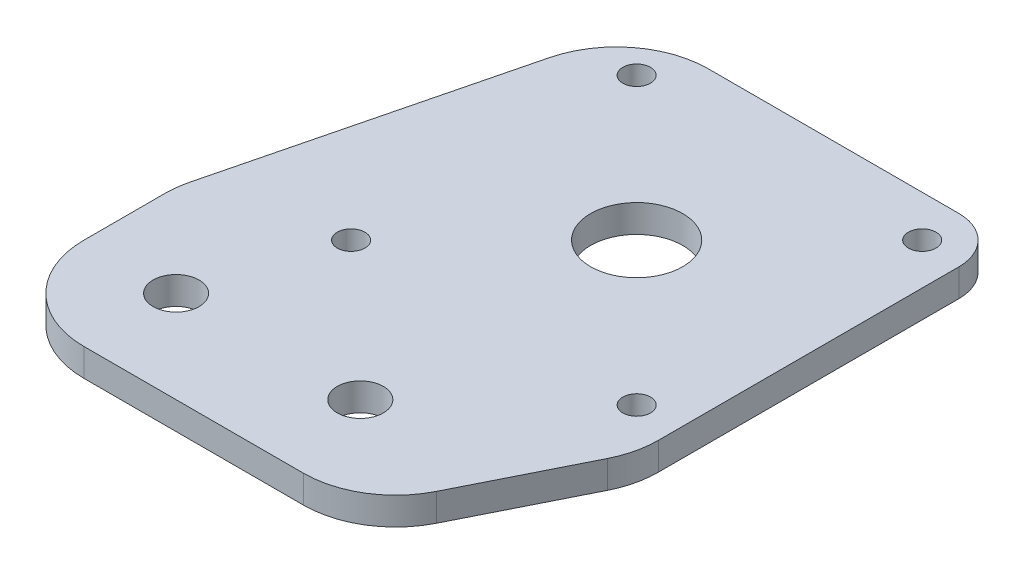
ISO-10303-21;
HEADER;
FILE_DESCRIPTION(('STEP AP214'),'2;1');
FILE_NAME('part.step','',(''),(''),'','','');
FILE_SCHEMA(('AUTOMOTIVE_DESIGN { 1 0 10303 214 1 1 1 1 }'));
ENDSEC;
DATA;
#1=APPLICATION_CONTEXT('core data for automotive mechanical design processes');
#2=APPLICATION_PROTOCOL_DEFINITION('international standard','automotive_design',2000,#1);
#3=PRODUCT_CONTEXT('',#1,'mechanical');
#4=PRODUCT('Part','Part','',(#3));
#5=PRODUCT_RELATED_PRODUCT_CATEGORY('part','',(#4));
#6=PRODUCT_DEFINITION_FORMATION('','',#4);
#7=PRODUCT_DEFINITION_CONTEXT('part definition',#1,'design');
#8=PRODUCT_DEFINITION('design','',#6,#7);
#9=PRODUCT_DEFINITION_SHAPE('','',#8);
#10=(LENGTH_UNIT() NAMED_UNIT(*) SI_UNIT(.MILLI.,.METRE.));
#11=(NAMED_UNIT(*) PLANE_ANGLE_UNIT() SI_UNIT($,.RADIAN.));
#12=(NAMED_UNIT(*) SI_UNIT($,.STERADIAN.) SOLID_ANGLE_UNIT());
#13=UNCERTAINTY_MEASURE_WITH_UNIT(LENGTH_MEASURE(1.E-05),#10,'distance_accuracy_value','');
#14=(GEOMETRIC_REPRESENTATION_CONTEXT(3) GLOBAL_UNCERTAINTY_ASSIGNED_CONTEXT((#13)) GLOBAL_UNIT_ASSIGNED_CONTEXT((#10,
#11,#12)) REPRESENTATION_CONTEXT('',''));
#15=CARTESIAN_POINT('',(0.,0.,0.));
#16=DIRECTION('',(0.,0.,1.));
#17=DIRECTION('',(1.,0.,0.));
#18=AXIS2_PLACEMENT_3D('',#15,#16,#17);
#19=CARTESIAN_POINT('',(0.,3.,0.));
#20=DIRECTION('',(0.,-1.,0.));
#21=DIRECTION('',(0.,0.,-1.));
#22=AXIS2_PLACEMENT_3D('',#19,#20,#21);
#23=PLANE('',#22);
#24=CARTESIAN_POINT('',(0.,3.,30.));
#25=DIRECTION('',(0.,1.,0.));
#26=DIRECTION('',(0.,0.,1.));
#27=AXIS2_PLACEMENT_3D('',#24,#25,#26);
#28=CIRCLE('',#27,2.5);
#29=CARTESIAN_POINT('',(0.,3.,32.5));
#30=VERTEX_POINT('',#29);
#31=EDGE_CURVE('E273',#30,#30,#28,.T.);
#32=ORIENTED_EDGE('',*,*,#31,.F.);
#33=EDGE_LOOP('',(#32));
#34=FACE_BOUND('',#33,.T.);
#35=CARTESIAN_POINT('',(-20.,3.,30.));
#36=DIRECTION('',(0.,1.,0.));
#37=DIRECTION('',(0.,0.,1.));
#38=AXIS2_PLACEMENT_3D('',#35,#36,#37);
#39=CIRCLE('',#38,2.5);
#40=CARTESIAN_POINT('',(-20.,3.,32.5));
#41=VERTEX_POINT('',#40);
#42=EDGE_CURVE('E267',#41,#41,#39,.T.);
#43=ORIENTED_EDGE('',*,*,#42,.F.);
#44=EDGE_LOOP('',(#43));
#45=FACE_BOUND('',#44,.T.);
#46=CARTESIAN_POINT('',(15.5,3.,-15.5));
#47=DIRECTION('',(0.,1.,0.));
#48=DIRECTION('',(0.,0.,1.));
#49=AXIS2_PLACEMENT_3D('',#46,#47,#48);
#50=CIRCLE('',#49,1.5);
#51=CARTESIAN_POINT('',(15.5,3.,-14.));
#52=VERTEX_POINT('',#51);
#53=EDGE_CURVE('E258',#52,#52,#50,.T.);
#54=ORIENTED_EDGE('',*,*,#53,.F.);
#55=EDGE_LOOP('',(#54));
#56=FACE_BOUND('',#55,.T.);
#57=CARTESIAN_POINT('',(-15.5,3.,-15.5));
#58=DIRECTION('',(0.,1.,0.));
#59=DIRECTION('',(0.,0.,1.));
#60=AXIS2_PLACEMENT_3D('',#57,#58,#59);
#61=CIRCLE('',#60,1.5);
#62=CARTESIAN_POINT('',(-15.5,3.,-14.));
#63=VERTEX_POINT('',#62);
#64=EDGE_CURVE('E255',#63,#63,#61,.T.);
#65=ORIENTED_EDGE('',*,*,#64,.F.);
#66=EDGE_LOOP('',(#65));
#67=FACE_BOUND('',#66,.T.);
#68=DIRECTION('',(0.,0.,-1.));
#69=VECTOR('',#68,1.);
#70=CARTESIAN_POINT('',(20.,3.,-20.));
#71=LINE('',#70,#69);
#72=CARTESIAN_POINT('',(20.,3.,17.6393202250021));
#73=VERTEX_POINT('',#72);
#74=CARTESIAN_POINT('',(20.,3.,-15.));
#75=VERTEX_POINT('',#74);
#76=EDGE_CURVE('E244',#73,#75,#71,.T.);
#77=ORIENTED_EDGE('',*,*,#76,.T.);
#78=CARTESIAN_POINT('',(15.,3.,-15.));
#79=DIRECTION('',(0.,-1.,0.));
#80=DIRECTION('',(0.,0.,-1.));
#81=AXIS2_PLACEMENT_3D('',#78,#79,#80);
#82=CIRCLE('',#81,5.);
#83=CARTESIAN_POINT('',(15.,3.,-20.));
#84=VERTEX_POINT('',#83);
#85=EDGE_CURVE('E11',#75,#84,#82,.F.);
#86=ORIENTED_EDGE('',*,*,#85,.T.);
#87=DIRECTION('',(-1.,0.,0.));
#88=VECTOR('',#87,1.);
#89=CARTESIAN_POINT('',(-20.,3.,-20.));
#90=LINE('',#89,#88);
#91=CARTESIAN_POINT('',(-12.1922359359558,3.,-20.));
#92=VERTEX_POINT('',#91);
#93=EDGE_CURVE('E225',#84,#92,#90,.T.);
#94=ORIENTED_EDGE('',*,*,#93,.T.);
#95=CARTESIAN_POINT('',(-12.1922359359559,3.,-10.));
#96=DIRECTION('',(0.,-1.,0.));
#97=DIRECTION('',(0.,0.,-1.));
#98=AXIS2_PLACEMENT_3D('',#95,#96,#97);
#99=CIRCLE('',#98,10.);
#100=CARTESIAN_POINT('',(-21.8936609374092,3.,-12.4253562503633));
#101=VERTEX_POINT('',#100);
#102=EDGE_CURVE('E194',#92,#101,#99,.F.);
#103=ORIENTED_EDGE('',*,*,#102,.T.);
#104=DIRECTION('',(-0.242535625036333,0.,0.970142500145332));
#105=VECTOR('',#104,1.);
#106=CARTESIAN_POINT('',(-20.,3.,-20.));
#107=LINE('',#106,#105);
#108=CARTESIAN_POINT('',(-29.7014250014533,3.,18.8057000058133));
#109=VERTEX_POINT('',#108);
#110=EDGE_CURVE('E238',#101,#109,#107,.T.);
#111=ORIENTED_EDGE('',*,*,#110,.T.);
#112=CARTESIAN_POINT('',(-20.,3.,21.2310562561766));
#113=DIRECTION('',(0.,-1.,0.));
#114=DIRECTION('',(0.,0.,-1.));
#115=AXIS2_PLACEMENT_3D('',#112,#113,#114);
#116=CIRCLE('',#115,10.);
#117=CARTESIAN_POINT('',(-30.,3.,21.2310562561766));
#118=VERTEX_POINT('',#117);
#119=EDGE_CURVE('E192',#109,#118,#116,.F.);
#120=ORIENTED_EDGE('',*,*,#119,.T.);
#121=DIRECTION('',(0.,0.,1.));
#122=VECTOR('',#121,1.);
#123=CARTESIAN_POINT('',(-30.,3.,20.));
#124=LINE('',#123,#122);
#125=CARTESIAN_POINT('',(-30.,3.,30.));
#126=VERTEX_POINT('',#125);
#127=EDGE_CURVE('E158',#118,#126,#124,.T.);
#128=ORIENTED_EDGE('',*,*,#127,.T.);
#129=CARTESIAN_POINT('',(-20.,3.,30.));
#130=DIRECTION('',(0.,-1.,0.));
#131=DIRECTION('',(0.,0.,-1.));
#132=AXIS2_PLACEMENT_3D('',#129,#130,#131);
#133=CIRCLE('',#132,10.);
#134=CARTESIAN_POINT('',(-20.,3.,40.));
#135=VERTEX_POINT('',#134);
#136=EDGE_CURVE('E200',#126,#135,#133,.F.);
#137=ORIENTED_EDGE('',*,*,#136,.T.);
#138=DIRECTION('',(1.,0.,0.));
#139=VECTOR('',#138,1.);
#140=CARTESIAN_POINT('',(-30.,3.,40.));
#141=LINE('',#140,#139);
#142=CARTESIAN_POINT('',(3.81966011250106,3.,40.));
#143=VERTEX_POINT('',#142);
#144=EDGE_CURVE('E141',#135,#143,#141,.T.);
#145=ORIENTED_EDGE('',*,*,#144,.T.);
#146=CARTESIAN_POINT('',(3.81966011250106,3.,30.));
#147=DIRECTION('',(0.,-1.,0.));
#148=DIRECTION('',(0.,0.,-1.));
#149=AXIS2_PLACEMENT_3D('',#146,#147,#148);
#150=CIRCLE('',#149,10.);
#151=CARTESIAN_POINT('',(12.7639320225002,3.,34.4721359549996));
#152=VERTEX_POINT('',#151);
#153=EDGE_CURVE('E198',#143,#152,#150,.F.);
#154=ORIENTED_EDGE('',*,*,#153,.T.);
#155=DIRECTION('',(0.447213595499958,0.,-0.894427190999916));
#156=VECTOR('',#155,1.);
#157=CARTESIAN_POINT('',(20.,3.,20.));
#158=LINE('',#157,#156);
#159=CARTESIAN_POINT('',(18.9442719099992,3.,22.1114561800017));
#160=VERTEX_POINT('',#159);
#161=EDGE_CURVE('E248',#152,#160,#158,.T.);
#162=ORIENTED_EDGE('',*,*,#161,.T.);
#163=CARTESIAN_POINT('',(10.,3.,17.6393202250021));
#164=DIRECTION('',(0.,-1.,0.));
#165=DIRECTION('',(0.,0.,-1.));
#166=AXIS2_PLACEMENT_3D('',#163,#164,#165);
#167=CIRCLE('',#166,10.);
#168=EDGE_CURVE('E196',#160,#73,#167,.F.);
#169=ORIENTED_EDGE('',*,*,#168,.T.);
#170=EDGE_LOOP('',(#77,#86,#94,#103,#111,#120,#128,#137,#145,#154,#162,#169));
#171=FACE_BOUND('',#170,.T.);
#172=CARTESIAN_POINT('',(0.,3.,0.));
#173=DIRECTION('',(0.,1.,0.));
#174=DIRECTION('',(0.,0.,1.));
#175=AXIS2_PLACEMENT_3D('',#172,#173,#174);
#176=CIRCLE('',#175,5.);
#177=CARTESIAN_POINT('',(0.,3.,5.));
#178=VERTEX_POINT('',#177);
#179=EDGE_CURVE('E149',#178,#178,#176,.T.);
#180=ORIENTED_EDGE('',*,*,#179,.F.);
#181=EDGE_LOOP('',(#180));
#182=FACE_BOUND('',#181,.T.);
#183=CARTESIAN_POINT('',(-15.5,3.,15.5));
#184=DIRECTION('',(0.,1.,0.));
#185=DIRECTION('',(0.,0.,1.));
#186=AXIS2_PLACEMENT_3D('',#183,#184,#185);
#187=CIRCLE('',#186,1.5);
#188=CARTESIAN_POINT('',(-15.5,3.,17.));
#189=VERTEX_POINT('',#188);
#190=EDGE_CURVE('E172',#189,#189,#187,.T.);
#191=ORIENTED_EDGE('',*,*,#190,.F.);
#192=EDGE_LOOP('',(#191));
#193=FACE_BOUND('',#192,.T.);
#194=CARTESIAN_POINT('',(15.5,3.,15.5));
#195=DIRECTION('',(0.,1.,0.));
#196=DIRECTION('',(0.,0.,1.));
#197=AXIS2_PLACEMENT_3D('',#194,#195,#196);
#198=CIRCLE('',#197,1.5);
#199=CARTESIAN_POINT('',(15.5,3.,17.));
#200=VERTEX_POINT('',#199);
#201=EDGE_CURVE('E178',#200,#200,#198,.T.);
#202=ORIENTED_EDGE('',*,*,#201,.F.);
#203=EDGE_LOOP('',(#202));
#204=FACE_BOUND('',#203,.T.);
#205=ADVANCED_FACE('F33',(#34,#45,#56,#67,#171,#182,#193,#204),#23,.F.);
#206=CARTESIAN_POINT('',(0.,0.,0.));
#207=DIRECTION('',(0.,-1.,0.));
#208=DIRECTION('',(0.,0.,-1.));
#209=AXIS2_PLACEMENT_3D('',#206,#207,#208);
#210=PLANE('',#209);
#211=CARTESIAN_POINT('',(0.,0.,30.));
#212=DIRECTION('',(0.,1.,0.));
#213=DIRECTION('',(0.,0.,1.));
#214=AXIS2_PLACEMENT_3D('',#211,#212,#213);
#215=CIRCLE('',#214,2.5);
#216=CARTESIAN_POINT('',(0.,0.,32.5));
#217=VERTEX_POINT('',#216);
#218=EDGE_CURVE('E270',#217,#217,#215,.T.);
#219=ORIENTED_EDGE('',*,*,#218,.T.);
#220=EDGE_LOOP('',(#219));
#221=FACE_BOUND('',#220,.T.);
#222=CARTESIAN_POINT('',(-20.,0.,30.));
#223=DIRECTION('',(0.,1.,0.));
#224=DIRECTION('',(0.,0.,1.));
#225=AXIS2_PLACEMENT_3D('',#222,#223,#224);
#226=CIRCLE('',#225,2.5);
#227=CARTESIAN_POINT('',(-20.,0.,32.5));
#228=VERTEX_POINT('',#227);
#229=EDGE_CURVE('E266',#228,#228,#226,.T.);
#230=ORIENTED_EDGE('',*,*,#229,.T.);
#231=EDGE_LOOP('',(#230));
#232=FACE_BOUND('',#231,.T.);
#233=CARTESIAN_POINT('',(15.5,0.,-15.5));
#234=DIRECTION('',(0.,1.,0.));
#235=DIRECTION('',(0.,0.,1.));
#236=AXIS2_PLACEMENT_3D('',#233,#234,#235);
#237=CIRCLE('',#236,1.5);
#238=CARTESIAN_POINT('',(15.5,0.,-14.));
#239=VERTEX_POINT('',#238);
#240=EDGE_CURVE('E263',#239,#239,#237,.T.);
#241=ORIENTED_EDGE('',*,*,#240,.T.);
#242=EDGE_LOOP('',(#241));
#243=FACE_BOUND('',#242,.T.);
#244=CARTESIAN_POINT('',(-15.5,0.,-15.5));
#245=DIRECTION('',(0.,1.,0.));
#246=DIRECTION('',(0.,0.,1.));
#247=AXIS2_PLACEMENT_3D('',#244,#245,#246);
#248=CIRCLE('',#247,1.5);
#249=CARTESIAN_POINT('',(-15.5,0.,-14.));
#250=VERTEX_POINT('',#249);
#251=EDGE_CURVE('E253',#250,#250,#248,.T.);
#252=ORIENTED_EDGE('',*,*,#251,.T.);
#253=EDGE_LOOP('',(#252));
#254=FACE_BOUND('',#253,.T.);
#255=DIRECTION('',(-1.,0.,0.));
#256=VECTOR('',#255,1.);
#257=CARTESIAN_POINT('',(-20.,0.,-20.));
#258=LINE('',#257,#256);
#259=CARTESIAN_POINT('',(15.,0.,-20.));
#260=VERTEX_POINT('',#259);
#261=CARTESIAN_POINT('',(-12.1922359359558,0.,-20.));
#262=VERTEX_POINT('',#261);
#263=EDGE_CURVE('E162',#260,#262,#258,.T.);
#264=ORIENTED_EDGE('',*,*,#263,.F.);
#265=CARTESIAN_POINT('',(15.,0.,-15.));
#266=DIRECTION('',(0.,-1.,0.));
#267=DIRECTION('',(0.,0.,-1.));
#268=AXIS2_PLACEMENT_3D('',#265,#266,#267);
#269=CIRCLE('',#268,5.);
#270=CARTESIAN_POINT('',(20.,0.,-15.));
#271=VERTEX_POINT('',#270);
#272=EDGE_CURVE('E55',#260,#271,#269,.T.);
#273=ORIENTED_EDGE('',*,*,#272,.T.);
#274=DIRECTION('',(0.,0.,-1.));
#275=VECTOR('',#274,1.);
#276=CARTESIAN_POINT('',(20.,0.,-20.));
#277=LINE('',#276,#275);
#278=CARTESIAN_POINT('',(20.,0.,17.6393202250021));
#279=VERTEX_POINT('',#278);
#280=EDGE_CURVE('E152',#279,#271,#277,.T.);
#281=ORIENTED_EDGE('',*,*,#280,.F.);
#282=CARTESIAN_POINT('',(10.,0.,17.6393202250021));
#283=DIRECTION('',(0.,-1.,0.));
#284=DIRECTION('',(0.,0.,-1.));
#285=AXIS2_PLACEMENT_3D('',#282,#283,#284);
#286=CIRCLE('',#285,10.);
#287=CARTESIAN_POINT('',(18.9442719099992,0.,22.1114561800017));
#288=VERTEX_POINT('',#287);
#289=EDGE_CURVE('E186',#279,#288,#286,.T.);
#290=ORIENTED_EDGE('',*,*,#289,.T.);
#291=DIRECTION('',(0.447213595499958,0.,-0.894427190999916));
#292=VECTOR('',#291,1.);
#293=CARTESIAN_POINT('',(20.,0.,20.));
#294=LINE('',#293,#292);
#295=CARTESIAN_POINT('',(12.7639320225002,0.,34.4721359549996));
#296=VERTEX_POINT('',#295);
#297=EDGE_CURVE('E148',#296,#288,#294,.T.);
#298=ORIENTED_EDGE('',*,*,#297,.F.);
#299=CARTESIAN_POINT('',(3.81966011250106,0.,30.));
#300=DIRECTION('',(0.,-1.,0.));
#301=DIRECTION('',(0.,0.,-1.));
#302=AXIS2_PLACEMENT_3D('',#299,#300,#301);
#303=CIRCLE('',#302,10.);
#304=CARTESIAN_POINT('',(3.81966011250106,0.,40.));
#305=VERTEX_POINT('',#304);
#306=EDGE_CURVE('E132',#296,#305,#303,.T.);
#307=ORIENTED_EDGE('',*,*,#306,.T.);
#308=DIRECTION('',(1.,0.,0.));
#309=VECTOR('',#308,1.);
#310=CARTESIAN_POINT('',(-30.,0.,40.));
#311=LINE('',#310,#309);
#312=CARTESIAN_POINT('',(-20.,0.,40.));
#313=VERTEX_POINT('',#312);
#314=EDGE_CURVE('E138',#313,#305,#311,.T.);
#315=ORIENTED_EDGE('',*,*,#314,.F.);
#316=CARTESIAN_POINT('',(-20.,0.,30.));
#317=DIRECTION('',(0.,-1.,0.));
#318=DIRECTION('',(0.,0.,-1.));
#319=AXIS2_PLACEMENT_3D('',#316,#317,#318);
#320=CIRCLE('',#319,10.);
#321=CARTESIAN_POINT('',(-30.,0.,30.));
#322=VERTEX_POINT('',#321);
#323=EDGE_CURVE('E122',#313,#322,#320,.T.);
#324=ORIENTED_EDGE('',*,*,#323,.T.);
#325=DIRECTION('',(0.,0.,1.));
#326=VECTOR('',#325,1.);
#327=CARTESIAN_POINT('',(-30.,0.,20.));
#328=LINE('',#327,#326);
#329=CARTESIAN_POINT('',(-30.,0.,21.2310562561766));
#330=VERTEX_POINT('',#329);
#331=EDGE_CURVE('E167',#330,#322,#328,.T.);
#332=ORIENTED_EDGE('',*,*,#331,.F.);
#333=CARTESIAN_POINT('',(-20.,0.,21.2310562561766));
#334=DIRECTION('',(0.,-1.,0.));
#335=DIRECTION('',(0.,0.,-1.));
#336=AXIS2_PLACEMENT_3D('',#333,#334,#335);
#337=CIRCLE('',#336,10.);
#338=CARTESIAN_POINT('',(-29.7014250014533,0.,18.8057000058133));
#339=VERTEX_POINT('',#338);
#340=EDGE_CURVE('E142',#330,#339,#337,.T.);
#341=ORIENTED_EDGE('',*,*,#340,.T.);
#342=DIRECTION('',(-0.242535625036333,0.,0.970142500145332));
#343=VECTOR('',#342,1.);
#344=CARTESIAN_POINT('',(-20.,0.,-20.));
#345=LINE('',#344,#343);
#346=CARTESIAN_POINT('',(-21.8936609374092,0.,-12.4253562503633));
#347=VERTEX_POINT('',#346);
#348=EDGE_CURVE('E164',#347,#339,#345,.T.);
#349=ORIENTED_EDGE('',*,*,#348,.F.);
#350=CARTESIAN_POINT('',(-12.1922359359559,0.,-10.));
#351=DIRECTION('',(0.,-1.,0.));
#352=DIRECTION('',(0.,0.,-1.));
#353=AXIS2_PLACEMENT_3D('',#350,#351,#352);
#354=CIRCLE('',#353,10.);
#355=EDGE_CURVE('E183',#347,#262,#354,.T.);
#356=ORIENTED_EDGE('',*,*,#355,.T.);
#357=EDGE_LOOP('',(#264,#273,#281,#290,#298,#307,#315,#324,#332,#341,#349,#356));
#358=FACE_BOUND('',#357,.T.);
#359=CARTESIAN_POINT('',(0.,0.,0.));
#360=DIRECTION('',(0.,1.,0.));
#361=DIRECTION('',(0.,0.,1.));
#362=AXIS2_PLACEMENT_3D('',#359,#360,#361);
#363=CIRCLE('',#362,5.);
#364=CARTESIAN_POINT('',(0.,0.,5.));
#365=VERTEX_POINT('',#364);
#366=EDGE_CURVE('E155',#365,#365,#363,.T.);
#367=ORIENTED_EDGE('',*,*,#366,.T.);
#368=EDGE_LOOP('',(#367));
#369=FACE_BOUND('',#368,.T.);
#370=CARTESIAN_POINT('',(-15.5,0.,15.5));
#371=DIRECTION('',(0.,1.,0.));
#372=DIRECTION('',(0.,0.,1.));
#373=AXIS2_PLACEMENT_3D('',#370,#371,#372);
#374=CIRCLE('',#373,1.5);
#375=CARTESIAN_POINT('',(-15.5,0.,17.));
#376=VERTEX_POINT('',#375);
#377=EDGE_CURVE('E169',#376,#376,#374,.T.);
#378=ORIENTED_EDGE('',*,*,#377,.T.);
#379=EDGE_LOOP('',(#378));
#380=FACE_BOUND('',#379,.T.);
#381=CARTESIAN_POINT('',(15.5,0.,15.5));
#382=DIRECTION('',(0.,1.,0.));
#383=DIRECTION('',(0.,0.,1.));
#384=AXIS2_PLACEMENT_3D('',#381,#382,#383);
#385=CIRCLE('',#384,1.5);
#386=CARTESIAN_POINT('',(15.5,0.,17.));
#387=VERTEX_POINT('',#386);
#388=EDGE_CURVE('E175',#387,#387,#385,.T.);
#389=ORIENTED_EDGE('',*,*,#388,.T.);
#390=EDGE_LOOP('',(#389));
#391=FACE_BOUND('',#390,.T.);
#392=ADVANCED_FACE('F145',(#221,#232,#243,#254,#358,#369,#380,#391),#210,.T.);
#393=CARTESIAN_POINT('',(-30.,3.,40.));
#394=DIRECTION('',(0.,0.,-1.));
#395=DIRECTION('',(-1.,0.,0.));
#396=AXIS2_PLACEMENT_3D('',#393,#394,#395);
#397=PLANE('',#396);
#398=ORIENTED_EDGE('',*,*,#144,.F.);
#399=DIRECTION('',(0.,-1.,0.));
#400=VECTOR('',#399,1.);
#401=CARTESIAN_POINT('',(-20.,3.,40.));
#402=LINE('',#401,#400);
#403=EDGE_CURVE('E126',#135,#313,#402,.T.);
#404=ORIENTED_EDGE('',*,*,#403,.T.);
#405=ORIENTED_EDGE('',*,*,#314,.T.);
#406=DIRECTION('',(0.,-1.,0.));
#407=VECTOR('',#406,1.);
#408=CARTESIAN_POINT('',(3.81966011250106,3.,40.));
#409=LINE('',#408,#407);
#410=EDGE_CURVE('E143',#305,#143,#409,.F.);
#411=ORIENTED_EDGE('',*,*,#410,.T.);
#412=EDGE_LOOP('',(#398,#404,#405,#411));
#413=FACE_BOUND('',#412,.T.);
#414=ADVANCED_FACE('F137',(#413),#397,.F.);
#415=CARTESIAN_POINT('',(20.,3.,20.));
#416=DIRECTION('',(-0.894427190999916,0.,-0.447213595499958));
#417=DIRECTION('',(-0.447213595499958,0.,0.894427190999916));
#418=AXIS2_PLACEMENT_3D('',#415,#416,#417);
#419=PLANE('',#418);
#420=ORIENTED_EDGE('',*,*,#161,.F.);
#421=DIRECTION('',(0.,-1.,0.));
#422=VECTOR('',#421,1.);
#423=CARTESIAN_POINT('',(12.7639320225002,3.,34.4721359549996));
#424=LINE('',#423,#422);
#425=EDGE_CURVE('E204',#152,#296,#424,.T.);
#426=ORIENTED_EDGE('',*,*,#425,.T.);
#427=ORIENTED_EDGE('',*,*,#297,.T.);
#428=DIRECTION('',(0.,-1.,0.));
#429=VECTOR('',#428,1.);
#430=CARTESIAN_POINT('',(18.9442719099992,3.,22.1114561800017));
#431=LINE('',#430,#429);
#432=EDGE_CURVE('E202',#288,#160,#431,.F.);
#433=ORIENTED_EDGE('',*,*,#432,.T.);
#434=EDGE_LOOP('',(#420,#426,#427,#433));
#435=FACE_BOUND('',#434,.T.);
#436=ADVANCED_FACE('F328',(#435),#419,.F.);
#437=CARTESIAN_POINT('',(20.,3.,-20.));
#438=DIRECTION('',(-1.,0.,0.));
#439=DIRECTION('',(0.,0.,1.));
#440=AXIS2_PLACEMENT_3D('',#437,#438,#439);
#441=PLANE('',#440);
#442=ORIENTED_EDGE('',*,*,#280,.T.);
#443=DIRECTION('',(0.,-1.,0.));
#444=VECTOR('',#443,1.);
#445=CARTESIAN_POINT('',(20.,3.,-15.));
#446=LINE('',#445,#444);
#447=EDGE_CURVE('E41',#271,#75,#446,.F.);
#448=ORIENTED_EDGE('',*,*,#447,.T.);
#449=ORIENTED_EDGE('',*,*,#76,.F.);
#450=DIRECTION('',(0.,-1.,0.));
#451=VECTOR('',#450,1.);
#452=CARTESIAN_POINT('',(20.,3.,17.6393202250021));
#453=LINE('',#452,#451);
#454=EDGE_CURVE('E207',#73,#279,#453,.T.);
#455=ORIENTED_EDGE('',*,*,#454,.T.);
#456=EDGE_LOOP('',(#442,#448,#449,#455));
#457=FACE_BOUND('',#456,.T.);
#458=ADVANCED_FACE('F325',(#457),#441,.F.);
#459=CARTESIAN_POINT('',(-20.,3.,-20.));
#460=DIRECTION('',(0.,0.,1.));
#461=DIRECTION('',(1.,0.,0.));
#462=AXIS2_PLACEMENT_3D('',#459,#460,#461);
#463=PLANE('',#462);
#464=ORIENTED_EDGE('',*,*,#93,.F.);
#465=DIRECTION('',(0.,-1.,0.));
#466=VECTOR('',#465,1.);
#467=CARTESIAN_POINT('',(15.,3.,-20.));
#468=LINE('',#467,#466);
#469=EDGE_CURVE('E218',#84,#260,#468,.T.);
#470=ORIENTED_EDGE('',*,*,#469,.T.);
#471=ORIENTED_EDGE('',*,*,#263,.T.);
#472=DIRECTION('',(0.,-1.,0.));
#473=VECTOR('',#472,1.);
#474=CARTESIAN_POINT('',(-12.1922359359558,3.,-20.));
#475=LINE('',#474,#473);
#476=EDGE_CURVE('E215',#262,#92,#475,.F.);
#477=ORIENTED_EDGE('',*,*,#476,.T.);
#478=EDGE_LOOP('',(#464,#470,#471,#477));
#479=FACE_BOUND('',#478,.T.);
#480=ADVANCED_FACE('F224',(#479),#463,.F.);
#481=CARTESIAN_POINT('',(-20.,3.,-20.));
#482=DIRECTION('',(0.970142500145332,0.,0.242535625036333));
#483=DIRECTION('',(0.242535625036333,0.,-0.970142500145332));
#484=AXIS2_PLACEMENT_3D('',#481,#482,#483);
#485=PLANE('',#484);
#486=ORIENTED_EDGE('',*,*,#110,.F.);
#487=DIRECTION('',(0.,-1.,0.));
#488=VECTOR('',#487,1.);
#489=CARTESIAN_POINT('',(-21.8936609374092,3.,-12.4253562503633));
#490=LINE('',#489,#488);
#491=EDGE_CURVE('E212',#101,#347,#490,.T.);
#492=ORIENTED_EDGE('',*,*,#491,.T.);
#493=ORIENTED_EDGE('',*,*,#348,.T.);
#494=DIRECTION('',(0.,-1.,0.));
#495=VECTOR('',#494,1.);
#496=CARTESIAN_POINT('',(-29.7014250014533,3.,18.8057000058133));
#497=LINE('',#496,#495);
#498=EDGE_CURVE('E210',#339,#109,#497,.F.);
#499=ORIENTED_EDGE('',*,*,#498,.T.);
#500=EDGE_LOOP('',(#486,#492,#493,#499));
#501=FACE_BOUND('',#500,.T.);
#502=ADVANCED_FACE('F241',(#501),#485,.F.);
#503=CARTESIAN_POINT('',(-30.,3.,20.));
#504=DIRECTION('',(1.,0.,0.));
#505=DIRECTION('',(0.,0.,-1.));
#506=AXIS2_PLACEMENT_3D('',#503,#504,#505);
#507=PLANE('',#506);
#508=ORIENTED_EDGE('',*,*,#331,.T.);
#509=DIRECTION('',(0.,-1.,0.));
#510=VECTOR('',#509,1.);
#511=CARTESIAN_POINT('',(-30.,3.,30.));
#512=LINE('',#511,#510);
#513=EDGE_CURVE('E127',#322,#126,#512,.F.);
#514=ORIENTED_EDGE('',*,*,#513,.T.);
#515=ORIENTED_EDGE('',*,*,#127,.F.);
#516=DIRECTION('',(0.,-1.,0.));
#517=VECTOR('',#516,1.);
#518=CARTESIAN_POINT('',(-30.,3.,21.2310562561766));
#519=LINE('',#518,#517);
#520=EDGE_CURVE('E131',#118,#330,#519,.T.);
#521=ORIENTED_EDGE('',*,*,#520,.T.);
#522=EDGE_LOOP('',(#508,#514,#515,#521));
#523=FACE_BOUND('',#522,.T.);
#524=ADVANCED_FACE('F310',(#523),#507,.F.);
#525=CARTESIAN_POINT('',(0.,3.,0.));
#526=DIRECTION('',(0.,-1.,0.));
#527=DIRECTION('',(0.,0.,-1.));
#528=AXIS2_PLACEMENT_3D('',#525,#526,#527);
#529=CYLINDRICAL_SURFACE('',#528,5.);
#530=ORIENTED_EDGE('',*,*,#179,.T.);
#531=EDGE_LOOP('',(#530));
#532=FACE_BOUND('',#531,.T.);
#533=ORIENTED_EDGE('',*,*,#366,.F.);
#534=EDGE_LOOP('',(#533));
#535=FACE_BOUND('',#534,.T.);
#536=ADVANCED_FACE('F300',(#532,#535),#529,.F.);
#537=CARTESIAN_POINT('',(-15.5,0.,-15.5));
#538=DIRECTION('',(0.,1.,0.));
#539=DIRECTION('',(0.,0.,1.));
#540=AXIS2_PLACEMENT_3D('',#537,#538,#539);
#541=CYLINDRICAL_SURFACE('',#540,1.5);
#542=ORIENTED_EDGE('',*,*,#251,.F.);
#543=EDGE_LOOP('',(#542));
#544=FACE_BOUND('',#543,.T.);
#545=ORIENTED_EDGE('',*,*,#64,.T.);
#546=EDGE_LOOP('',(#545));
#547=FACE_BOUND('',#546,.T.);
#548=ADVANCED_FACE('F297',(#544,#547),#541,.F.);
#549=CARTESIAN_POINT('',(15.5,0.,-15.5));
#550=DIRECTION('',(0.,1.,0.));
#551=DIRECTION('',(0.,0.,1.));
#552=AXIS2_PLACEMENT_3D('',#549,#550,#551);
#553=CYLINDRICAL_SURFACE('',#552,1.5);
#554=ORIENTED_EDGE('',*,*,#240,.F.);
#555=EDGE_LOOP('',(#554));
#556=FACE_BOUND('',#555,.T.);
#557=ORIENTED_EDGE('',*,*,#53,.T.);
#558=EDGE_LOOP('',(#557));
#559=FACE_BOUND('',#558,.T.);
#560=ADVANCED_FACE('F299',(#556,#559),#553,.F.);
#561=CARTESIAN_POINT('',(-15.5,0.,15.5));
#562=DIRECTION('',(0.,1.,0.));
#563=DIRECTION('',(0.,0.,1.));
#564=AXIS2_PLACEMENT_3D('',#561,#562,#563);
#565=CYLINDRICAL_SURFACE('',#564,1.5);
#566=ORIENTED_EDGE('',*,*,#377,.F.);
#567=EDGE_LOOP('',(#566));
#568=FACE_BOUND('',#567,.T.);
#569=ORIENTED_EDGE('',*,*,#190,.T.);
#570=EDGE_LOOP('',(#569));
#571=FACE_BOUND('',#570,.T.);
#572=ADVANCED_FACE('F307',(#568,#571),#565,.F.);
#573=CARTESIAN_POINT('',(15.5,0.,15.5));
#574=DIRECTION('',(0.,1.,0.));
#575=DIRECTION('',(0.,0.,1.));
#576=AXIS2_PLACEMENT_3D('',#573,#574,#575);
#577=CYLINDRICAL_SURFACE('',#576,1.5);
#578=ORIENTED_EDGE('',*,*,#388,.F.);
#579=EDGE_LOOP('',(#578));
#580=FACE_BOUND('',#579,.T.);
#581=ORIENTED_EDGE('',*,*,#201,.T.);
#582=EDGE_LOOP('',(#581));
#583=FACE_BOUND('',#582,.T.);
#584=ADVANCED_FACE('F336',(#580,#583),#577,.F.);
#585=CARTESIAN_POINT('',(-20.,0.,30.));
#586=DIRECTION('',(0.,1.,0.));
#587=DIRECTION('',(0.,0.,1.));
#588=AXIS2_PLACEMENT_3D('',#585,#586,#587);
#589=CYLINDRICAL_SURFACE('',#588,2.5);
#590=ORIENTED_EDGE('',*,*,#229,.F.);
#591=EDGE_LOOP('',(#590));
#592=FACE_BOUND('',#591,.T.);
#593=ORIENTED_EDGE('',*,*,#42,.T.);
#594=EDGE_LOOP('',(#593));
#595=FACE_BOUND('',#594,.T.);
#596=ADVANCED_FACE('F284',(#592,#595),#589,.F.);
#597=CARTESIAN_POINT('',(0.,0.,30.));
#598=DIRECTION('',(0.,1.,0.));
#599=DIRECTION('',(0.,0.,1.));
#600=AXIS2_PLACEMENT_3D('',#597,#598,#599);
#601=CYLINDRICAL_SURFACE('',#600,2.5);
#602=ORIENTED_EDGE('',*,*,#218,.F.);
#603=EDGE_LOOP('',(#602));
#604=FACE_BOUND('',#603,.T.);
#605=ORIENTED_EDGE('',*,*,#31,.T.);
#606=EDGE_LOOP('',(#605));
#607=FACE_BOUND('',#606,.T.);
#608=ADVANCED_FACE('F281',(#604,#607),#601,.F.);
#609=CARTESIAN_POINT('',(-20.,3.,30.));
#610=DIRECTION('',(0.,-1.,0.));
#611=DIRECTION('',(0.,0.,-1.));
#612=AXIS2_PLACEMENT_3D('',#609,#610,#611);
#613=CYLINDRICAL_SURFACE('',#612,10.);
#614=ORIENTED_EDGE('',*,*,#136,.F.);
#615=ORIENTED_EDGE('',*,*,#513,.F.);
#616=ORIENTED_EDGE('',*,*,#323,.F.);
#617=ORIENTED_EDGE('',*,*,#403,.F.);
#618=EDGE_LOOP('',(#614,#615,#616,#617));
#619=FACE_BOUND('',#618,.T.);
#620=ADVANCED_FACE('F125',(#619),#613,.T.);
#621=CARTESIAN_POINT('',(3.81966011250106,3.,30.));
#622=DIRECTION('',(0.,-1.,0.));
#623=DIRECTION('',(0.,0.,-1.));
#624=AXIS2_PLACEMENT_3D('',#621,#622,#623);
#625=CYLINDRICAL_SURFACE('',#624,10.);
#626=ORIENTED_EDGE('',*,*,#153,.F.);
#627=ORIENTED_EDGE('',*,*,#410,.F.);
#628=ORIENTED_EDGE('',*,*,#306,.F.);
#629=ORIENTED_EDGE('',*,*,#425,.F.);
#630=EDGE_LOOP('',(#626,#627,#628,#629));
#631=FACE_BOUND('',#630,.T.);
#632=ADVANCED_FACE('F343',(#631),#625,.T.);
#633=CARTESIAN_POINT('',(10.,3.,17.6393202250021));
#634=DIRECTION('',(0.,-1.,0.));
#635=DIRECTION('',(0.,0.,-1.));
#636=AXIS2_PLACEMENT_3D('',#633,#634,#635);
#637=CYLINDRICAL_SURFACE('',#636,10.);
#638=ORIENTED_EDGE('',*,*,#168,.F.);
#639=ORIENTED_EDGE('',*,*,#432,.F.);
#640=ORIENTED_EDGE('',*,*,#289,.F.);
#641=ORIENTED_EDGE('',*,*,#454,.F.);
#642=EDGE_LOOP('',(#638,#639,#640,#641));
#643=FACE_BOUND('',#642,.T.);
#644=ADVANCED_FACE('F346',(#643),#637,.T.);
#645=CARTESIAN_POINT('',(-12.1922359359559,3.,-10.));
#646=DIRECTION('',(0.,-1.,0.));
#647=DIRECTION('',(0.,0.,-1.));
#648=AXIS2_PLACEMENT_3D('',#645,#646,#647);
#649=CYLINDRICAL_SURFACE('',#648,10.);
#650=ORIENTED_EDGE('',*,*,#102,.F.);
#651=ORIENTED_EDGE('',*,*,#476,.F.);
#652=ORIENTED_EDGE('',*,*,#355,.F.);
#653=ORIENTED_EDGE('',*,*,#491,.F.);
#654=EDGE_LOOP('',(#650,#651,#652,#653));
#655=FACE_BOUND('',#654,.T.);
#656=ADVANCED_FACE('F233',(#655),#649,.T.);
#657=CARTESIAN_POINT('',(-20.,3.,21.2310562561766));
#658=DIRECTION('',(0.,-1.,0.));
#659=DIRECTION('',(0.,0.,-1.));
#660=AXIS2_PLACEMENT_3D('',#657,#658,#659);
#661=CYLINDRICAL_SURFACE('',#660,10.);
#662=ORIENTED_EDGE('',*,*,#119,.F.);
#663=ORIENTED_EDGE('',*,*,#498,.F.);
#664=ORIENTED_EDGE('',*,*,#340,.F.);
#665=ORIENTED_EDGE('',*,*,#520,.F.);
#666=EDGE_LOOP('',(#662,#663,#664,#665));
#667=FACE_BOUND('',#666,.T.);
#668=ADVANCED_FACE('F352',(#667),#661,.T.);
#669=CARTESIAN_POINT('',(15.,3.,-15.));
#670=DIRECTION('',(0.,-1.,0.));
#671=DIRECTION('',(0.,0.,-1.));
#672=AXIS2_PLACEMENT_3D('',#669,#670,#671);
#673=CYLINDRICAL_SURFACE('',#672,5.);
#674=ORIENTED_EDGE('',*,*,#85,.F.);
#675=ORIENTED_EDGE('',*,*,#447,.F.);
#676=ORIENTED_EDGE('',*,*,#272,.F.);
#677=ORIENTED_EDGE('',*,*,#469,.F.);
#678=EDGE_LOOP('',(#674,#675,#676,#677));
#679=FACE_BOUND('',#678,.T.);
#680=ADVANCED_FACE('F35',(#679),#673,.T.);
#681=CLOSED_SHELL('',(#205,#392,#414,#436,#458,#480,#502,#524,#536,#548,#560,#572,#584,#596,
#608,#620,#632,#644,#656,#668,#680));
#682=MANIFOLD_SOLID_BREP('B2',#681);
#683=ADVANCED_BREP_SHAPE_REPRESENTATION('',(#18,#682),#14);
#684=SHAPE_DEFINITION_REPRESENTATION(#9,#683);
ENDSEC;
END-ISO-10303-21;
